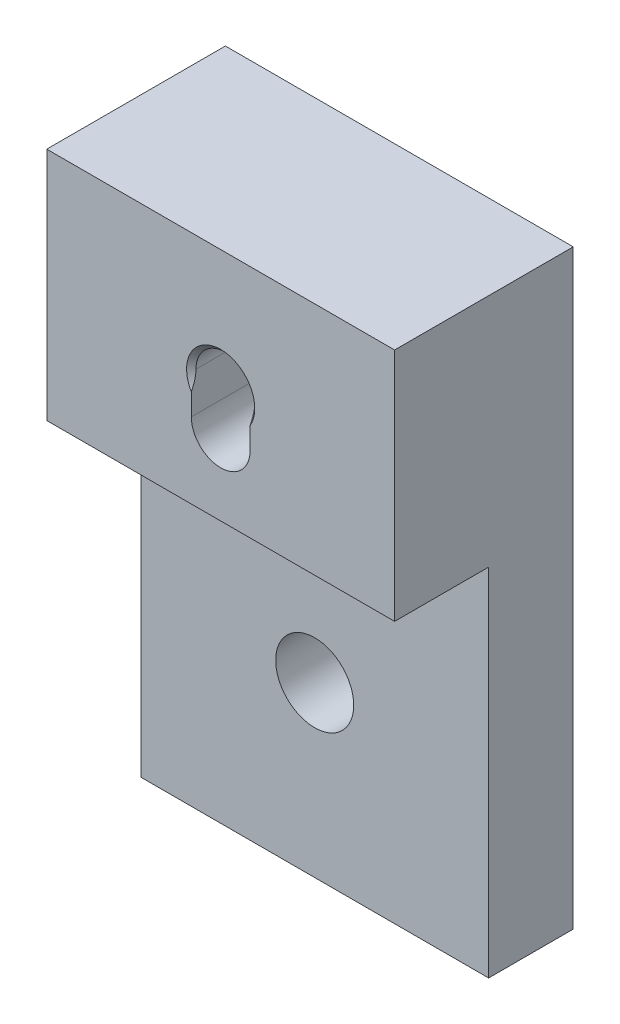
ISO-10303-21;
HEADER;
FILE_DESCRIPTION(('STEP AP214'),'2;1');
FILE_NAME('part.step','',(''),(''),'','','');
FILE_SCHEMA(('AUTOMOTIVE_DESIGN { 1 0 10303 214 1 1 1 1 }'));
ENDSEC;
DATA;
#1=APPLICATION_CONTEXT('core data for automotive mechanical design processes');
#2=APPLICATION_PROTOCOL_DEFINITION('international standard','automotive_design',2000,#1);
#3=PRODUCT_CONTEXT('',#1,'mechanical');
#4=PRODUCT('Part','Part','',(#3));
#5=PRODUCT_RELATED_PRODUCT_CATEGORY('part','',(#4));
#6=PRODUCT_DEFINITION_FORMATION('','',#4);
#7=PRODUCT_DEFINITION_CONTEXT('part definition',#1,'design');
#8=PRODUCT_DEFINITION('design','',#6,#7);
#9=PRODUCT_DEFINITION_SHAPE('','',#8);
#10=(LENGTH_UNIT() NAMED_UNIT(*) SI_UNIT(.MILLI.,.METRE.));
#11=(NAMED_UNIT(*) PLANE_ANGLE_UNIT() SI_UNIT($,.RADIAN.));
#12=(NAMED_UNIT(*) SI_UNIT($,.STERADIAN.) SOLID_ANGLE_UNIT());
#13=UNCERTAINTY_MEASURE_WITH_UNIT(LENGTH_MEASURE(1.E-05),#10,'distance_accuracy_value','');
#14=(GEOMETRIC_REPRESENTATION_CONTEXT(3) GLOBAL_UNCERTAINTY_ASSIGNED_CONTEXT((#13)) GLOBAL_UNIT_ASSIGNED_CONTEXT((#10,
#11,#12)) REPRESENTATION_CONTEXT('',''));
#15=CARTESIAN_POINT('',(0.,0.,0.));
#16=DIRECTION('',(0.,0.,1.));
#17=DIRECTION('',(1.,0.,0.));
#18=AXIS2_PLACEMENT_3D('',#15,#16,#17);
#19=CARTESIAN_POINT('',(0.,0.,19.));
#20=DIRECTION('',(0.,1.,0.));
#21=DIRECTION('',(0.,0.,1.));
#22=AXIS2_PLACEMENT_3D('',#19,#20,#21);
#23=PLANE('',#22);
#24=DIRECTION('',(1.,0.,0.));
#25=VECTOR('',#24,1.);
#26=CARTESIAN_POINT('',(0.,0.,9.));
#27=LINE('',#26,#25);
#28=CARTESIAN_POINT('',(0.,0.,9.));
#29=VERTEX_POINT('',#28);
#30=CARTESIAN_POINT('',(37.,0.,9.));
#31=VERTEX_POINT('',#30);
#32=EDGE_CURVE('E148',#29,#31,#27,.T.);
#33=ORIENTED_EDGE('',*,*,#32,.F.);
#34=DIRECTION('',(0.,0.,-1.));
#35=VECTOR('',#34,1.);
#36=CARTESIAN_POINT('',(0.,0.,19.));
#37=LINE('',#36,#35);
#38=CARTESIAN_POINT('',(0.,0.,0.));
#39=VERTEX_POINT('',#38);
#40=EDGE_CURVE('E187',#29,#39,#37,.T.);
#41=ORIENTED_EDGE('',*,*,#40,.T.);
#42=DIRECTION('',(1.,0.,0.));
#43=VECTOR('',#42,1.);
#44=CARTESIAN_POINT('',(0.,0.,0.));
#45=LINE('',#44,#43);
#46=CARTESIAN_POINT('',(37.,0.,0.));
#47=VERTEX_POINT('',#46);
#48=EDGE_CURVE('E174',#39,#47,#45,.T.);
#49=ORIENTED_EDGE('',*,*,#48,.T.);
#50=DIRECTION('',(0.,0.,-1.));
#51=VECTOR('',#50,1.);
#52=CARTESIAN_POINT('',(37.,0.,19.));
#53=LINE('',#52,#51);
#54=EDGE_CURVE('E185',#31,#47,#53,.T.);
#55=ORIENTED_EDGE('',*,*,#54,.F.);
#56=EDGE_LOOP('',(#33,#41,#49,#55));
#57=FACE_BOUND('',#56,.T.);
#58=ADVANCED_FACE('F16',(#57),#23,.F.);
#59=CARTESIAN_POINT('',(0.,0.,19.));
#60=DIRECTION('',(1.,0.,0.));
#61=DIRECTION('',(0.,0.,-1.));
#62=AXIS2_PLACEMENT_3D('',#59,#60,#61);
#63=PLANE('',#62);
#64=DIRECTION('',(0.,-1.,0.));
#65=VECTOR('',#64,1.);
#66=CARTESIAN_POINT('',(0.,37.85,9.));
#67=LINE('',#66,#65);
#68=CARTESIAN_POINT('',(0.,37.85,9.));
#69=VERTEX_POINT('',#68);
#70=EDGE_CURVE('E146',#69,#29,#67,.T.);
#71=ORIENTED_EDGE('',*,*,#70,.F.);
#72=DIRECTION('',(0.,0.,1.));
#73=VECTOR('',#72,1.);
#74=CARTESIAN_POINT('',(0.,37.85,9.));
#75=LINE('',#74,#73);
#76=CARTESIAN_POINT('',(0.,37.85,19.));
#77=VERTEX_POINT('',#76);
#78=EDGE_CURVE('E158',#69,#77,#75,.T.);
#79=ORIENTED_EDGE('',*,*,#78,.T.);
#80=DIRECTION('',(0.,-1.,0.));
#81=VECTOR('',#80,1.);
#82=CARTESIAN_POINT('',(0.,0.,19.));
#83=LINE('',#82,#81);
#84=CARTESIAN_POINT('',(0.,62.85,19.));
#85=VERTEX_POINT('',#84);
#86=EDGE_CURVE('E163',#85,#77,#83,.T.);
#87=ORIENTED_EDGE('',*,*,#86,.F.);
#88=DIRECTION('',(0.,0.,-1.));
#89=VECTOR('',#88,1.);
#90=CARTESIAN_POINT('',(0.,62.85,19.));
#91=LINE('',#90,#89);
#92=CARTESIAN_POINT('',(0.,62.85,0.));
#93=VERTEX_POINT('',#92);
#94=EDGE_CURVE('E171',#85,#93,#91,.T.);
#95=ORIENTED_EDGE('',*,*,#94,.T.);
#96=DIRECTION('',(0.,-1.,0.));
#97=VECTOR('',#96,1.);
#98=CARTESIAN_POINT('',(0.,0.,0.));
#99=LINE('',#98,#97);
#100=EDGE_CURVE('E161',#93,#39,#99,.T.);
#101=ORIENTED_EDGE('',*,*,#100,.T.);
#102=ORIENTED_EDGE('',*,*,#40,.F.);
#103=EDGE_LOOP('',(#71,#79,#87,#95,#101,#102));
#104=FACE_BOUND('',#103,.T.);
#105=ADVANCED_FACE('F250',(#104),#63,.F.);
#106=CARTESIAN_POINT('',(37.,0.,19.));
#107=DIRECTION('',(-1.,0.,0.));
#108=DIRECTION('',(0.,0.,1.));
#109=AXIS2_PLACEMENT_3D('',#106,#107,#108);
#110=PLANE('',#109);
#111=DIRECTION('',(0.,1.,0.));
#112=VECTOR('',#111,1.);
#113=CARTESIAN_POINT('',(37.,0.,19.));
#114=LINE('',#113,#112);
#115=CARTESIAN_POINT('',(37.,37.85,19.));
#116=VERTEX_POINT('',#115);
#117=CARTESIAN_POINT('',(37.,62.85,19.));
#118=VERTEX_POINT('',#117);
#119=EDGE_CURVE('E166',#116,#118,#114,.T.);
#120=ORIENTED_EDGE('',*,*,#119,.F.);
#121=DIRECTION('',(0.,0.,1.));
#122=VECTOR('',#121,1.);
#123=CARTESIAN_POINT('',(37.,37.85,9.));
#124=LINE('',#123,#122);
#125=CARTESIAN_POINT('',(37.,37.85,9.));
#126=VERTEX_POINT('',#125);
#127=EDGE_CURVE('E156',#126,#116,#124,.T.);
#128=ORIENTED_EDGE('',*,*,#127,.F.);
#129=DIRECTION('',(0.,1.,0.));
#130=VECTOR('',#129,1.);
#131=CARTESIAN_POINT('',(37.,37.85,9.));
#132=LINE('',#131,#130);
#133=EDGE_CURVE('E151',#31,#126,#132,.T.);
#134=ORIENTED_EDGE('',*,*,#133,.F.);
#135=ORIENTED_EDGE('',*,*,#54,.T.);
#136=DIRECTION('',(0.,1.,0.));
#137=VECTOR('',#136,1.);
#138=CARTESIAN_POINT('',(37.,0.,0.));
#139=LINE('',#138,#137);
#140=CARTESIAN_POINT('',(37.,62.85,0.));
#141=VERTEX_POINT('',#140);
#142=EDGE_CURVE('E177',#47,#141,#139,.T.);
#143=ORIENTED_EDGE('',*,*,#142,.T.);
#144=DIRECTION('',(0.,0.,-1.));
#145=VECTOR('',#144,1.);
#146=CARTESIAN_POINT('',(37.,62.85,19.));
#147=LINE('',#146,#145);
#148=EDGE_CURVE('E182',#118,#141,#147,.T.);
#149=ORIENTED_EDGE('',*,*,#148,.F.);
#150=EDGE_LOOP('',(#120,#128,#134,#135,#143,#149));
#151=FACE_BOUND('',#150,.T.);
#152=ADVANCED_FACE('F246',(#151),#110,.F.);
#153=CARTESIAN_POINT('',(0.,62.85,19.));
#154=DIRECTION('',(0.,-1.,0.));
#155=DIRECTION('',(0.,0.,-1.));
#156=AXIS2_PLACEMENT_3D('',#153,#154,#155);
#157=PLANE('',#156);
#158=DIRECTION('',(-1.,0.,0.));
#159=VECTOR('',#158,1.);
#160=CARTESIAN_POINT('',(0.,62.85,0.));
#161=LINE('',#160,#159);
#162=EDGE_CURVE('E167',#141,#93,#161,.T.);
#163=ORIENTED_EDGE('',*,*,#162,.T.);
#164=ORIENTED_EDGE('',*,*,#94,.F.);
#165=DIRECTION('',(-1.,0.,0.));
#166=VECTOR('',#165,1.);
#167=CARTESIAN_POINT('',(0.,62.85,19.));
#168=LINE('',#167,#166);
#169=EDGE_CURVE('E169',#118,#85,#168,.T.);
#170=ORIENTED_EDGE('',*,*,#169,.F.);
#171=ORIENTED_EDGE('',*,*,#148,.T.);
#172=EDGE_LOOP('',(#163,#164,#170,#171));
#173=FACE_BOUND('',#172,.T.);
#174=ADVANCED_FACE('F240',(#173),#157,.F.);
#175=CARTESIAN_POINT('',(0.,0.,19.));
#176=DIRECTION('',(0.,0.,-1.));
#177=DIRECTION('',(-1.,0.,0.));
#178=AXIS2_PLACEMENT_3D('',#175,#176,#177);
#179=PLANE('',#178);
#180=DIRECTION('',(0.,-1.,0.));
#181=VECTOR('',#180,1.);
#182=CARTESIAN_POINT('',(15.375,50.025,19.));
#183=LINE('',#182,#181);
#184=CARTESIAN_POINT('',(15.375,48.1878826929127,19.));
#185=VERTEX_POINT('',#184);
#186=CARTESIAN_POINT('',(15.375,45.875,19.));
#187=VERTEX_POINT('',#186);
#188=EDGE_CURVE('E137',#185,#187,#183,.T.);
#189=ORIENTED_EDGE('',*,*,#188,.F.);
#190=CARTESIAN_POINT('',(18.5,50.025,19.));
#191=DIRECTION('',(0.,0.,-1.));
#192=DIRECTION('',(-1.,0.,0.));
#193=AXIS2_PLACEMENT_3D('',#190,#191,#192);
#194=CIRCLE('',#193,3.62499999999998);
#195=CARTESIAN_POINT('',(21.625,48.1878826929126,19.));
#196=VERTEX_POINT('',#195);
#197=EDGE_CURVE('E10',#185,#196,#194,.T.);
#198=ORIENTED_EDGE('',*,*,#197,.T.);
#199=DIRECTION('',(0.,1.,0.));
#200=VECTOR('',#199,1.);
#201=CARTESIAN_POINT('',(21.625,50.025,19.));
#202=LINE('',#201,#200);
#203=CARTESIAN_POINT('',(21.625,45.875,19.));
#204=VERTEX_POINT('',#203);
#205=EDGE_CURVE('E134',#204,#196,#202,.T.);
#206=ORIENTED_EDGE('',*,*,#205,.F.);
#207=CARTESIAN_POINT('',(18.5,45.875,19.));
#208=DIRECTION('',(0.,0.,1.));
#209=DIRECTION('',(1.,0.,0.));
#210=AXIS2_PLACEMENT_3D('',#207,#208,#209);
#211=CIRCLE('',#210,3.12499999999998);
#212=EDGE_CURVE('E116',#187,#204,#211,.T.);
#213=ORIENTED_EDGE('',*,*,#212,.F.);
#214=EDGE_LOOP('',(#189,#198,#206,#213));
#215=FACE_BOUND('',#214,.T.);
#216=ORIENTED_EDGE('',*,*,#86,.T.);
#217=DIRECTION('',(-1.,0.,0.));
#218=VECTOR('',#217,1.);
#219=CARTESIAN_POINT('',(0.,37.85,19.));
#220=LINE('',#219,#218);
#221=EDGE_CURVE('E149',#116,#77,#220,.T.);
#222=ORIENTED_EDGE('',*,*,#221,.F.);
#223=ORIENTED_EDGE('',*,*,#119,.T.);
#224=ORIENTED_EDGE('',*,*,#169,.T.);
#225=EDGE_LOOP('',(#216,#222,#223,#224));
#226=FACE_BOUND('',#225,.T.);
#227=ADVANCED_FACE('F237',(#215,#226),#179,.F.);
#228=CARTESIAN_POINT('',(0.,0.,0.));
#229=DIRECTION('',(0.,0.,-1.));
#230=DIRECTION('',(-1.,0.,0.));
#231=AXIS2_PLACEMENT_3D('',#228,#229,#230);
#232=PLANE('',#231);
#233=CARTESIAN_POINT('',(18.5,17.95,0.));
#234=DIRECTION('',(0.,0.,-1.));
#235=DIRECTION('',(-1.,0.,0.));
#236=AXIS2_PLACEMENT_3D('',#233,#234,#235);
#237=CIRCLE('',#236,4.65);
#238=CARTESIAN_POINT('',(13.85,17.95,0.));
#239=VERTEX_POINT('',#238);
#240=EDGE_CURVE('E193',#239,#239,#237,.F.);
#241=ORIENTED_EDGE('',*,*,#240,.T.);
#242=EDGE_LOOP('',(#241));
#243=FACE_BOUND('',#242,.T.);
#244=DIRECTION('',(0.,1.,0.));
#245=VECTOR('',#244,1.);
#246=CARTESIAN_POINT('',(21.625,50.025,0.));
#247=LINE('',#246,#245);
#248=CARTESIAN_POINT('',(21.625,45.875,0.));
#249=VERTEX_POINT('',#248);
#250=CARTESIAN_POINT('',(21.625,48.1878826929126,0.));
#251=VERTEX_POINT('',#250);
#252=EDGE_CURVE('E121',#249,#251,#247,.T.);
#253=ORIENTED_EDGE('',*,*,#252,.T.);
#254=CARTESIAN_POINT('',(18.5,50.025,0.));
#255=DIRECTION('',(0.,0.,-1.));
#256=DIRECTION('',(-1.,0.,0.));
#257=AXIS2_PLACEMENT_3D('',#254,#255,#256);
#258=CIRCLE('',#257,3.62499999999998);
#259=CARTESIAN_POINT('',(15.375,48.1878826929127,0.));
#260=VERTEX_POINT('',#259);
#261=EDGE_CURVE('E189',#251,#260,#258,.F.);
#262=ORIENTED_EDGE('',*,*,#261,.T.);
#263=DIRECTION('',(0.,-1.,0.));
#264=VECTOR('',#263,1.);
#265=CARTESIAN_POINT('',(15.375,50.025,0.));
#266=LINE('',#265,#264);
#267=CARTESIAN_POINT('',(15.375,45.875,0.));
#268=VERTEX_POINT('',#267);
#269=EDGE_CURVE('E132',#260,#268,#266,.T.);
#270=ORIENTED_EDGE('',*,*,#269,.T.);
#271=CARTESIAN_POINT('',(18.5,45.875,0.));
#272=DIRECTION('',(0.,0.,1.));
#273=DIRECTION('',(1.,0.,0.));
#274=AXIS2_PLACEMENT_3D('',#271,#272,#273);
#275=CIRCLE('',#274,3.12499999999998);
#276=EDGE_CURVE('E113',#268,#249,#275,.T.);
#277=ORIENTED_EDGE('',*,*,#276,.T.);
#278=EDGE_LOOP('',(#253,#262,#270,#277));
#279=FACE_BOUND('',#278,.T.);
#280=ORIENTED_EDGE('',*,*,#100,.F.);
#281=ORIENTED_EDGE('',*,*,#162,.F.);
#282=ORIENTED_EDGE('',*,*,#142,.F.);
#283=ORIENTED_EDGE('',*,*,#48,.F.);
#284=EDGE_LOOP('',(#280,#281,#282,#283));
#285=FACE_BOUND('',#284,.T.);
#286=ADVANCED_FACE('F129',(#243,#279,#285),#232,.T.);
#287=CARTESIAN_POINT('',(0.,37.85,9.));
#288=DIRECTION('',(0.,1.,0.));
#289=DIRECTION('',(0.,0.,1.));
#290=AXIS2_PLACEMENT_3D('',#287,#288,#289);
#291=PLANE('',#290);
#292=ORIENTED_EDGE('',*,*,#221,.T.);
#293=ORIENTED_EDGE('',*,*,#78,.F.);
#294=DIRECTION('',(-1.,0.,0.));
#295=VECTOR('',#294,1.);
#296=CARTESIAN_POINT('',(0.,37.85,9.));
#297=LINE('',#296,#295);
#298=EDGE_CURVE('E153',#126,#69,#297,.T.);
#299=ORIENTED_EDGE('',*,*,#298,.F.);
#300=ORIENTED_EDGE('',*,*,#127,.T.);
#301=EDGE_LOOP('',(#292,#293,#299,#300));
#302=FACE_BOUND('',#301,.T.);
#303=ADVANCED_FACE('F232',(#302),#291,.F.);
#304=CARTESIAN_POINT('',(0.,0.,9.));
#305=DIRECTION('',(0.,0.,1.));
#306=DIRECTION('',(1.,0.,0.));
#307=AXIS2_PLACEMENT_3D('',#304,#305,#306);
#308=PLANE('',#307);
#309=CARTESIAN_POINT('',(18.5,17.95,9.));
#310=DIRECTION('',(0.,0.,1.));
#311=DIRECTION('',(1.,0.,0.));
#312=AXIS2_PLACEMENT_3D('',#309,#310,#311);
#313=CIRCLE('',#312,4.15);
#314=CARTESIAN_POINT('',(22.65,17.95,9.));
#315=VERTEX_POINT('',#314);
#316=EDGE_CURVE('E141',#315,#315,#313,.T.);
#317=ORIENTED_EDGE('',*,*,#316,.F.);
#318=EDGE_LOOP('',(#317));
#319=FACE_BOUND('',#318,.T.);
#320=ORIENTED_EDGE('',*,*,#70,.T.);
#321=ORIENTED_EDGE('',*,*,#32,.T.);
#322=ORIENTED_EDGE('',*,*,#133,.T.);
#323=ORIENTED_EDGE('',*,*,#298,.T.);
#324=EDGE_LOOP('',(#320,#321,#322,#323));
#325=FACE_BOUND('',#324,.T.);
#326=ADVANCED_FACE('F228',(#319,#325),#308,.T.);
#327=CARTESIAN_POINT('',(18.5,17.95,0.));
#328=DIRECTION('',(0.,0.,1.));
#329=DIRECTION('',(1.,0.,0.));
#330=AXIS2_PLACEMENT_3D('',#327,#328,#329);
#331=CYLINDRICAL_SURFACE('',#330,4.15);
#332=CARTESIAN_POINT('',(18.5,17.95,0.499999999999994));
#333=DIRECTION('',(0.,0.,-1.));
#334=DIRECTION('',(-1.,0.,0.));
#335=AXIS2_PLACEMENT_3D('',#332,#333,#334);
#336=CIRCLE('',#335,4.15);
#337=CARTESIAN_POINT('',(14.35,17.95,0.499999999999994));
#338=VERTEX_POINT('',#337);
#339=EDGE_CURVE('E196',#338,#338,#336,.T.);
#340=ORIENTED_EDGE('',*,*,#339,.T.);
#341=EDGE_LOOP('',(#340));
#342=FACE_BOUND('',#341,.T.);
#343=ORIENTED_EDGE('',*,*,#316,.T.);
#344=EDGE_LOOP('',(#343));
#345=FACE_BOUND('',#344,.T.);
#346=ADVANCED_FACE('F224',(#342,#345),#331,.F.);
#347=CARTESIAN_POINT('',(18.5,50.025,0.));
#348=DIRECTION('',(0.,0.,1.));
#349=DIRECTION('',(1.,0.,0.));
#350=AXIS2_PLACEMENT_3D('',#347,#348,#349);
#351=CYLINDRICAL_SURFACE('',#350,3.12499999999999);
#352=DIRECTION('',(0.,0.,1.));
#353=VECTOR('',#352,1.);
#354=CARTESIAN_POINT('',(15.375,50.025,0.));
#355=LINE('',#354,#353);
#356=CARTESIAN_POINT('',(15.375,50.025,0.499999999999994));
#357=VERTEX_POINT('',#356);
#358=CARTESIAN_POINT('',(15.375,50.025,18.5));
#359=VERTEX_POINT('',#358);
#360=EDGE_CURVE('E127',#357,#359,#355,.T.);
#361=ORIENTED_EDGE('',*,*,#360,.F.);
#362=CARTESIAN_POINT('',(18.5,50.025,0.499999999999994));
#363=DIRECTION('',(0.,0.,-1.));
#364=DIRECTION('',(-1.,0.,0.));
#365=AXIS2_PLACEMENT_3D('',#362,#363,#364);
#366=CIRCLE('',#365,3.12499999999999);
#367=CARTESIAN_POINT('',(21.625,50.025,0.499999999999994));
#368=VERTEX_POINT('',#367);
#369=EDGE_CURVE('E395',#357,#368,#366,.T.);
#370=ORIENTED_EDGE('',*,*,#369,.T.);
#371=DIRECTION('',(0.,0.,1.));
#372=VECTOR('',#371,1.);
#373=CARTESIAN_POINT('',(21.625,50.025,0.));
#374=LINE('',#373,#372);
#375=CARTESIAN_POINT('',(21.625,50.025,18.5));
#376=VERTEX_POINT('',#375);
#377=EDGE_CURVE('E117',#368,#376,#374,.T.);
#378=ORIENTED_EDGE('',*,*,#377,.T.);
#379=CARTESIAN_POINT('',(18.5,50.025,18.5));
#380=DIRECTION('',(0.,0.,-1.));
#381=DIRECTION('',(-1.,0.,0.));
#382=AXIS2_PLACEMENT_3D('',#379,#380,#381);
#383=CIRCLE('',#382,3.12499999999999);
#384=EDGE_CURVE('E394',#376,#359,#383,.F.);
#385=ORIENTED_EDGE('',*,*,#384,.T.);
#386=EDGE_LOOP('',(#361,#370,#378,#385));
#387=FACE_BOUND('',#386,.T.);
#388=ADVANCED_FACE('F220',(#387),#351,.F.);
#389=CARTESIAN_POINT('',(21.625,50.025,0.));
#390=DIRECTION('',(1.,0.,0.));
#391=DIRECTION('',(0.,0.,-1.));
#392=AXIS2_PLACEMENT_3D('',#389,#390,#391);
#393=PLANE('',#392);
#394=ORIENTED_EDGE('',*,*,#377,.F.);
#395=CARTESIAN_POINT('',(21.625,50.025,0.499999999999994));
#396=CARTESIAN_POINT('',(21.625,49.9769998716325,0.500003845623209));
#397=CARTESIAN_POINT('',(21.625,49.9290069156257,0.498893519433054));
#398=CARTESIAN_POINT('',(21.625,49.8331292254115,0.494480744607606));
#399=CARTESIAN_POINT('',(21.625,49.7852444753405,0.491178641479342));
#400=CARTESIAN_POINT('',(21.625,49.6420609048945,0.47805588967823));
#401=CARTESIAN_POINT('',(21.625,49.5470409695726,0.465018509844023));
#402=CARTESIAN_POINT('',(21.625,49.3598944890398,0.431313649736052));
#403=CARTESIAN_POINT('',(21.625,49.2677459176675,0.410765237331892));
#404=CARTESIAN_POINT('',(21.625,49.0851963642615,0.36293142722866));
#405=CARTESIAN_POINT('',(21.625,48.9947959622357,0.335643833594485));
#406=CARTESIAN_POINT('',(21.625,48.8440714941353,0.284807939214066));
#407=CARTESIAN_POINT('',(21.625,48.7832249603787,0.262780153814409));
#408=CARTESIAN_POINT('',(21.625,48.6624657540248,0.216331658216248));
#409=CARTESIAN_POINT('',(21.625,48.6025529063261,0.19191140311092));
#410=CARTESIAN_POINT('',(21.625,48.4829856393447,0.140680751011486));
#411=CARTESIAN_POINT('',(21.625,48.423341239146,0.11384710340789));
#412=CARTESIAN_POINT('',(21.625,48.3049503454737,0.0582826806848856));
#413=CARTESIAN_POINT('',(21.625,48.2462037410623,0.0295521423312854));
#414=CARTESIAN_POINT('',(21.625,48.1878826929126,0.));
#415=B_SPLINE_CURVE_WITH_KNOTS('',3,(#395,#396,#397,#398,#399,#400,#401,#402,#403,#404,#405,
#406,#407,#408,#409,#410,#411,#412,#413,#414),.UNSPECIFIED.,.F.,.F.,(4,2,2,2,2,2,2,2,2,4),(0.,
0.143973831311797,0.287924972285212,0.575254032780846,0.858212892687181,1.14126407553057,
1.33534838730332,1.52939585197102,1.72556882726436,1.92171736279258),.UNSPECIFIED.);
#416=EDGE_CURVE('E26',#368,#251,#415,.T.);
#417=ORIENTED_EDGE('',*,*,#416,.T.);
#418=ORIENTED_EDGE('',*,*,#252,.F.);
#419=DIRECTION('',(0.,0.,1.));
#420=VECTOR('',#419,1.);
#421=CARTESIAN_POINT('',(21.625,45.875,0.));
#422=LINE('',#421,#420);
#423=EDGE_CURVE('E108',#249,#204,#422,.T.);
#424=ORIENTED_EDGE('',*,*,#423,.T.);
#425=ORIENTED_EDGE('',*,*,#205,.T.);
#426=CARTESIAN_POINT('',(21.625,48.1878826929126,19.));
#427=CARTESIAN_POINT('',(21.625,48.2513428845795,18.9678452394058));
#428=CARTESIAN_POINT('',(21.625,48.3152960053491,18.9366665215368));
#429=CARTESIAN_POINT('',(21.625,48.4442986494337,18.8765669675284));
#430=CARTESIAN_POINT('',(21.625,48.5093488013155,18.8476474832764));
#431=CARTESIAN_POINT('',(21.625,48.7070131158063,18.7644494288444));
#432=CARTESIAN_POINT('',(21.625,48.8413531399389,18.7141397713022));
#433=CARTESIAN_POINT('',(21.625,49.1104204174292,18.628662213466));
#434=CARTESIAN_POINT('',(21.625,49.2450160582848,18.5930866484875));
#435=CARTESIAN_POINT('',(21.625,49.5172021253509,18.5382048514129));
#436=CARTESIAN_POINT('',(21.625,49.6547815606067,18.518846799551));
#437=CARTESIAN_POINT('',(21.625,49.8314737256599,18.5057477586734));
#438=CARTESIAN_POINT('',(21.625,49.8700507785652,18.503600223493));
#439=CARTESIAN_POINT('',(21.625,49.9474158298544,18.5007240251971));
#440=CARTESIAN_POINT('',(21.625,49.9862040453463,18.5000012058315));
#441=CARTESIAN_POINT('',(21.625,50.025,18.5));
#442=B_SPLINE_CURVE_WITH_KNOTS('',3,(#426,#427,#428,#429,#430,#431,#432,#433,#434,#435,#436,
#437,#438,#439,#440,#441),.UNSPECIFIED.,.F.,.F.,(4,2,2,2,2,2,2,4),(0.,0.2134072271026,
0.426941190629335,0.856665410596437,1.27354429474627,1.6890859909145,1.80497746576232,
1.92134331101002),.UNSPECIFIED.);
#443=EDGE_CURVE('E38',#196,#376,#442,.T.);
#444=ORIENTED_EDGE('',*,*,#443,.T.);
#445=EDGE_LOOP('',(#394,#417,#418,#424,#425,#444));
#446=FACE_BOUND('',#445,.T.);
#447=ADVANCED_FACE('F122',(#446),#393,.F.);
#448=CARTESIAN_POINT('',(18.5,45.875,0.));
#449=DIRECTION('',(0.,0.,1.));
#450=DIRECTION('',(1.,0.,0.));
#451=AXIS2_PLACEMENT_3D('',#448,#449,#450);
#452=CYLINDRICAL_SURFACE('',#451,3.12499999999998);
#453=ORIENTED_EDGE('',*,*,#212,.T.);
#454=ORIENTED_EDGE('',*,*,#423,.F.);
#455=ORIENTED_EDGE('',*,*,#276,.F.);
#456=DIRECTION('',(0.,0.,1.));
#457=VECTOR('',#456,1.);
#458=CARTESIAN_POINT('',(15.375,45.875,0.));
#459=LINE('',#458,#457);
#460=EDGE_CURVE('E118',#268,#187,#459,.T.);
#461=ORIENTED_EDGE('',*,*,#460,.T.);
#462=EDGE_LOOP('',(#453,#454,#455,#461));
#463=FACE_BOUND('',#462,.T.);
#464=ADVANCED_FACE('F110',(#463),#452,.F.);
#465=CARTESIAN_POINT('',(15.375,50.025,0.));
#466=DIRECTION('',(-1.,0.,0.));
#467=DIRECTION('',(0.,-1.,0.));
#468=AXIS2_PLACEMENT_3D('',#465,#466,#467);
#469=PLANE('',#468);
#470=ORIENTED_EDGE('',*,*,#269,.F.);
#471=CARTESIAN_POINT('',(15.375,48.1878826929127,0.));
#472=CARTESIAN_POINT('',(15.375,48.2513428845795,0.0321547605941625));
#473=CARTESIAN_POINT('',(15.375,48.3152960053491,0.0633334784631878));
#474=CARTESIAN_POINT('',(15.375,48.4442986494337,0.123433032471573));
#475=CARTESIAN_POINT('',(15.375,48.5093488013155,0.152352516723602));
#476=CARTESIAN_POINT('',(15.375,48.7070131158063,0.23555057115555));
#477=CARTESIAN_POINT('',(15.375,48.8413531399389,0.28586022869776));
#478=CARTESIAN_POINT('',(15.375,49.1104204174292,0.371337786534011));
#479=CARTESIAN_POINT('',(15.375,49.2450160582848,0.406913351512449));
#480=CARTESIAN_POINT('',(15.375,49.5172021253509,0.46179514858707));
#481=CARTESIAN_POINT('',(15.375,49.6547815606067,0.481153200449021));
#482=CARTESIAN_POINT('',(15.375,49.8314737256599,0.494252241326614));
#483=CARTESIAN_POINT('',(15.375,49.8700507785652,0.496399776507011));
#484=CARTESIAN_POINT('',(15.375,49.9474158298544,0.499275974802873));
#485=CARTESIAN_POINT('',(15.375,49.9862040453463,0.499998794168453));
#486=CARTESIAN_POINT('',(15.375,50.025,0.499999999999984));
#487=B_SPLINE_CURVE_WITH_KNOTS('',3,(#471,#472,#473,#474,#475,#476,#477,#478,#479,#480,#481,
#482,#483,#484,#485,#486),.UNSPECIFIED.,.F.,.F.,(4,2,2,2,2,2,2,4),(0.,0.213407227102598,
0.426941190629319,0.856665410596414,1.27354429474624,1.68908599091446,1.80497746576228,
1.92134331100998),.UNSPECIFIED.);
#488=EDGE_CURVE('E206',#260,#357,#487,.T.);
#489=ORIENTED_EDGE('',*,*,#488,.T.);
#490=ORIENTED_EDGE('',*,*,#360,.T.);
#491=CARTESIAN_POINT('',(15.375,50.025,18.5));
#492=CARTESIAN_POINT('',(15.375,49.9769998716325,18.4999961543768));
#493=CARTESIAN_POINT('',(15.375,49.9290069156257,18.501106480567));
#494=CARTESIAN_POINT('',(15.375,49.8331292254115,18.5055192553924));
#495=CARTESIAN_POINT('',(15.375,49.7852444753405,18.5088213585207));
#496=CARTESIAN_POINT('',(15.375,49.6420609048945,18.5219441103218));
#497=CARTESIAN_POINT('',(15.375,49.5470409695726,18.534981490156));
#498=CARTESIAN_POINT('',(15.375,49.3598944890398,18.568686350264));
#499=CARTESIAN_POINT('',(15.375,49.2677459176674,18.5892347626681));
#500=CARTESIAN_POINT('',(15.375,49.0851963642615,18.6370685727714));
#501=CARTESIAN_POINT('',(15.375,48.9947959622357,18.6643561664055));
#502=CARTESIAN_POINT('',(15.375,48.8440714941352,18.715192060786));
#503=CARTESIAN_POINT('',(15.375,48.7832249603787,18.7372198461856));
#504=CARTESIAN_POINT('',(15.375,48.6624657540248,18.7836683417838));
#505=CARTESIAN_POINT('',(15.375,48.6025529063261,18.8080885968891));
#506=CARTESIAN_POINT('',(15.375,48.4829856393447,18.8593192489885));
#507=CARTESIAN_POINT('',(15.375,48.423341239146,18.8861528965921));
#508=CARTESIAN_POINT('',(15.375,48.3049503454737,18.9417173193151));
#509=CARTESIAN_POINT('',(15.375,48.2462037410623,18.9704478576687));
#510=CARTESIAN_POINT('',(15.375,48.1878826929127,19.));
#511=B_SPLINE_CURVE_WITH_KNOTS('',3,(#491,#492,#493,#494,#495,#496,#497,#498,#499,#500,#501,
#502,#503,#504,#505,#506,#507,#508,#509,#510),.UNSPECIFIED.,.F.,.F.,(4,2,2,2,2,2,2,2,2,4),(0.,
0.143973831311811,0.287924972285226,0.575254032780867,0.85821289268721,1.14126407553059,
1.33534838730332,1.529395851971,1.72556882726432,1.92171736279254),.UNSPECIFIED.);
#512=EDGE_CURVE('E199',#359,#185,#511,.T.);
#513=ORIENTED_EDGE('',*,*,#512,.T.);
#514=ORIENTED_EDGE('',*,*,#188,.T.);
#515=ORIENTED_EDGE('',*,*,#460,.F.);
#516=EDGE_LOOP('',(#470,#489,#490,#513,#514,#515));
#517=FACE_BOUND('',#516,.T.);
#518=ADVANCED_FACE('F212',(#517),#469,.F.);
#519=CARTESIAN_POINT('',(18.5,17.95,0.));
#520=DIRECTION('',(0.,0.,-1.));
#521=DIRECTION('',(-1.,0.,0.));
#522=AXIS2_PLACEMENT_3D('',#519,#520,#521);
#523=CONICAL_SURFACE('',#522,4.65,0.785398163397455);
#524=ORIENTED_EDGE('',*,*,#339,.F.);
#525=EDGE_LOOP('',(#524));
#526=FACE_BOUND('',#525,.T.);
#527=ORIENTED_EDGE('',*,*,#240,.F.);
#528=EDGE_LOOP('',(#527));
#529=FACE_BOUND('',#528,.T.);
#530=ADVANCED_FACE('F217',(#526,#529),#523,.F.);
#531=CARTESIAN_POINT('',(18.5,50.025,0.));
#532=DIRECTION('',(0.,0.,-1.));
#533=DIRECTION('',(-1.,0.,0.));
#534=AXIS2_PLACEMENT_3D('',#531,#532,#533);
#535=CONICAL_SURFACE('',#534,3.62499999999998,0.785398163397444);
#536=ORIENTED_EDGE('',*,*,#416,.F.);
#537=ORIENTED_EDGE('',*,*,#369,.F.);
#538=ORIENTED_EDGE('',*,*,#488,.F.);
#539=ORIENTED_EDGE('',*,*,#261,.F.);
#540=EDGE_LOOP('',(#536,#537,#538,#539));
#541=FACE_BOUND('',#540,.T.);
#542=ADVANCED_FACE('F264',(#541),#535,.F.);
#543=CARTESIAN_POINT('',(18.5,50.025,18.5));
#544=DIRECTION('',(0.,0.,1.));
#545=DIRECTION('',(1.,0.,0.));
#546=AXIS2_PLACEMENT_3D('',#543,#544,#545);
#547=CONICAL_SURFACE('',#546,3.12499999999999,0.785398163397452);
#548=ORIENTED_EDGE('',*,*,#443,.F.);
#549=ORIENTED_EDGE('',*,*,#197,.F.);
#550=ORIENTED_EDGE('',*,*,#512,.F.);
#551=ORIENTED_EDGE('',*,*,#384,.F.);
#552=EDGE_LOOP('',(#548,#549,#550,#551));
#553=FACE_BOUND('',#552,.T.);
#554=ADVANCED_FACE('F19',(#553),#547,.F.);
#555=CLOSED_SHELL('',(#58,#105,#152,#174,#227,#286,#303,#326,#346,#388,#447,#464,#518,#530,#542,#554));
#556=MANIFOLD_SOLID_BREP('B1',#555);
#557=ADVANCED_BREP_SHAPE_REPRESENTATION('',(#18,#556),#14);
#558=SHAPE_DEFINITION_REPRESENTATION(#9,#557);
ENDSEC;
END-ISO-10303-21;
